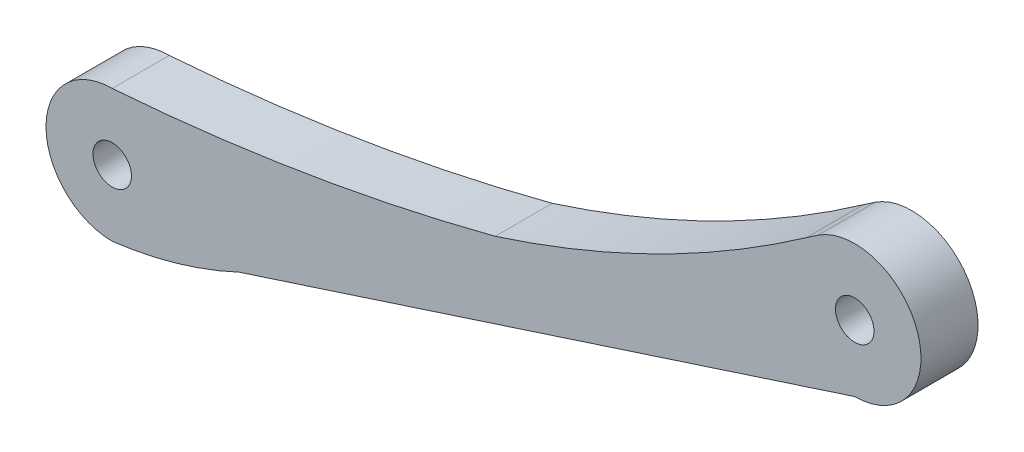
ISO-10303-21;
HEADER;
FILE_DESCRIPTION(('STEP AP214'),'2;1');
FILE_NAME('part.step','',(''),(''),'','','');
FILE_SCHEMA(('AUTOMOTIVE_DESIGN { 1 0 10303 214 1 1 1 1 }'));
ENDSEC;
DATA;
#1=APPLICATION_CONTEXT('core data for automotive mechanical design processes');
#2=APPLICATION_PROTOCOL_DEFINITION('international standard','automotive_design',2000,#1);
#3=PRODUCT_CONTEXT('',#1,'mechanical');
#4=PRODUCT('Part','Part','',(#3));
#5=PRODUCT_RELATED_PRODUCT_CATEGORY('part','',(#4));
#6=PRODUCT_DEFINITION_FORMATION('','',#4);
#7=PRODUCT_DEFINITION_CONTEXT('part definition',#1,'design');
#8=PRODUCT_DEFINITION('design','',#6,#7);
#9=PRODUCT_DEFINITION_SHAPE('','',#8);
#10=(LENGTH_UNIT() NAMED_UNIT(*) SI_UNIT(.MILLI.,.METRE.));
#11=(NAMED_UNIT(*) PLANE_ANGLE_UNIT() SI_UNIT($,.RADIAN.));
#12=(NAMED_UNIT(*) SI_UNIT($,.STERADIAN.) SOLID_ANGLE_UNIT());
#13=UNCERTAINTY_MEASURE_WITH_UNIT(LENGTH_MEASURE(1.E-05),#10,'distance_accuracy_value','');
#14=(GEOMETRIC_REPRESENTATION_CONTEXT(3) GLOBAL_UNCERTAINTY_ASSIGNED_CONTEXT((#13)) GLOBAL_UNIT_ASSIGNED_CONTEXT((#10,
#11,#12)) REPRESENTATION_CONTEXT('',''));
#15=CARTESIAN_POINT('',(0.,0.,0.));
#16=DIRECTION('',(0.,0.,1.));
#17=DIRECTION('',(1.,0.,0.));
#18=AXIS2_PLACEMENT_3D('',#15,#16,#17);
#19=CARTESIAN_POINT('',(3.52092702977232,128.68718187856,6.));
#20=DIRECTION('',(0.,0.,-1.));
#21=DIRECTION('',(-1.,0.,0.));
#22=AXIS2_PLACEMENT_3D('',#19,#20,#21);
#23=CYLINDRICAL_SURFACE('',#22,120.781117317153);
#24=CARTESIAN_POINT('',(3.52092702977232,128.68718187856,0.));
#25=DIRECTION('',(0.,0.,1.));
#26=DIRECTION('',(1.,0.,0.));
#27=AXIS2_PLACEMENT_3D('',#24,#25,#26);
#28=CIRCLE('',#27,120.781117317153);
#29=CARTESIAN_POINT('',(40.235925581119,13.6216041337166,0.));
#30=VERTEX_POINT('',#29);
#31=CARTESIAN_POINT('',(72.9383830734779,29.8474373584522,0.));
#32=VERTEX_POINT('',#31);
#33=EDGE_CURVE('E125',#30,#32,#28,.T.);
#34=ORIENTED_EDGE('',*,*,#33,.F.);
#35=DIRECTION('',(0.,0.,-1.));
#36=VECTOR('',#35,1.);
#37=CARTESIAN_POINT('',(40.235925581119,13.6216041337166,6.));
#38=LINE('',#37,#36);
#39=CARTESIAN_POINT('',(40.235925581119,13.6216041337166,6.));
#40=VERTEX_POINT('',#39);
#41=EDGE_CURVE('E11',#40,#30,#38,.T.);
#42=ORIENTED_EDGE('',*,*,#41,.F.);
#43=CARTESIAN_POINT('',(3.52092702977232,128.68718187856,6.));
#44=DIRECTION('',(0.,0.,1.));
#45=DIRECTION('',(1.,0.,0.));
#46=AXIS2_PLACEMENT_3D('',#43,#44,#45);
#47=CIRCLE('',#46,120.781117317153);
#48=CARTESIAN_POINT('',(72.9383830734779,29.8474373584522,6.));
#49=VERTEX_POINT('',#48);
#50=EDGE_CURVE('E145',#40,#49,#47,.T.);
#51=ORIENTED_EDGE('',*,*,#50,.T.);
#52=DIRECTION('',(0.,0.,-1.));
#53=VECTOR('',#52,1.);
#54=CARTESIAN_POINT('',(72.9383830734779,29.8474373584522,6.));
#55=LINE('',#54,#53);
#56=EDGE_CURVE('E80',#49,#32,#55,.T.);
#57=ORIENTED_EDGE('',*,*,#56,.T.);
#58=EDGE_LOOP('',(#34,#42,#51,#57));
#59=FACE_BOUND('',#58,.T.);
#60=ADVANCED_FACE('F32',(#59),#23,.F.);
#61=CARTESIAN_POINT('',(-16.5000266118403,231.345266574188,6.));
#62=DIRECTION('',(0.,0.,-1.));
#63=DIRECTION('',(-1.,0.,0.));
#64=AXIS2_PLACEMENT_3D('',#61,#62,#63);
#65=CYLINDRICAL_SURFACE('',#64,224.994580951929);
#66=CARTESIAN_POINT('',(-16.5000266118403,231.345266574188,0.));
#67=DIRECTION('',(0.,0.,1.));
#68=DIRECTION('',(1.,0.,0.));
#69=AXIS2_PLACEMENT_3D('',#66,#67,#68);
#70=CIRCLE('',#69,224.994580951929);
#71=CARTESIAN_POINT('',(0.,6.95651779309902,0.));
#72=VERTEX_POINT('',#71);
#73=EDGE_CURVE('E128',#72,#30,#70,.T.);
#74=ORIENTED_EDGE('',*,*,#73,.F.);
#75=DIRECTION('',(0.,0.,-1.));
#76=VECTOR('',#75,1.);
#77=CARTESIAN_POINT('',(0.,6.95651779309902,6.));
#78=LINE('',#77,#76);
#79=CARTESIAN_POINT('',(0.,6.95651779309902,6.));
#80=VERTEX_POINT('',#79);
#81=EDGE_CURVE('E40',#80,#72,#78,.T.);
#82=ORIENTED_EDGE('',*,*,#81,.F.);
#83=CARTESIAN_POINT('',(-16.5000266118403,231.345266574188,6.));
#84=DIRECTION('',(0.,0.,1.));
#85=DIRECTION('',(1.,0.,0.));
#86=AXIS2_PLACEMENT_3D('',#83,#84,#85);
#87=CIRCLE('',#86,224.994580951929);
#88=EDGE_CURVE('E166',#80,#40,#87,.T.);
#89=ORIENTED_EDGE('',*,*,#88,.T.);
#90=ORIENTED_EDGE('',*,*,#41,.T.);
#91=EDGE_LOOP('',(#74,#82,#89,#90));
#92=FACE_BOUND('',#91,.T.);
#93=ADVANCED_FACE('F165',(#92),#65,.F.);
#94=CARTESIAN_POINT('',(0.,0.,6.));
#95=DIRECTION('',(0.,0.,-1.));
#96=DIRECTION('',(-1.,0.,0.));
#97=AXIS2_PLACEMENT_3D('',#94,#95,#96);
#98=CYLINDRICAL_SURFACE('',#97,6.95651779309902);
#99=CARTESIAN_POINT('',(0.,0.,0.));
#100=DIRECTION('',(0.,0.,1.));
#101=DIRECTION('',(1.,0.,0.));
#102=AXIS2_PLACEMENT_3D('',#99,#100,#101);
#103=CIRCLE('',#102,6.95651779309902);
#104=CARTESIAN_POINT('',(0.,-6.95651779309902,0.));
#105=VERTEX_POINT('',#104);
#106=EDGE_CURVE('E131',#72,#105,#103,.T.);
#107=ORIENTED_EDGE('',*,*,#106,.T.);
#108=DIRECTION('',(0.,0.,-1.));
#109=VECTOR('',#108,1.);
#110=CARTESIAN_POINT('',(0.,-6.95651779309902,6.));
#111=LINE('',#110,#109);
#112=CARTESIAN_POINT('',(0.,-6.95651779309902,6.));
#113=VERTEX_POINT('',#112);
#114=EDGE_CURVE('E149',#113,#105,#111,.T.);
#115=ORIENTED_EDGE('',*,*,#114,.F.);
#116=CARTESIAN_POINT('',(0.,0.,6.));
#117=DIRECTION('',(0.,0.,1.));
#118=DIRECTION('',(1.,0.,0.));
#119=AXIS2_PLACEMENT_3D('',#116,#117,#118);
#120=CIRCLE('',#119,6.95651779309902);
#121=EDGE_CURVE('E156',#80,#113,#120,.T.);
#122=ORIENTED_EDGE('',*,*,#121,.F.);
#123=ORIENTED_EDGE('',*,*,#81,.T.);
#124=EDGE_LOOP('',(#107,#115,#122,#123));
#125=FACE_BOUND('',#124,.T.);
#126=ADVANCED_FACE('F154',(#125),#98,.T.);
#127=CARTESIAN_POINT('',(-5.43504198912419,36.7736432938048,6.));
#128=DIRECTION('',(0.,0.,-1.));
#129=DIRECTION('',(-1.,0.,0.));
#130=AXIS2_PLACEMENT_3D('',#127,#128,#129);
#131=CYLINDRICAL_SURFACE('',#130,44.0666162770651);
#132=CARTESIAN_POINT('',(-5.43504198912419,36.7736432938048,0.));
#133=DIRECTION('',(0.,0.,1.));
#134=DIRECTION('',(1.,0.,0.));
#135=AXIS2_PLACEMENT_3D('',#132,#133,#134);
#136=CIRCLE('',#135,44.0666162770651);
#137=CARTESIAN_POINT('',(13.3235006682701,-3.10095698608287,0.));
#138=VERTEX_POINT('',#137);
#139=EDGE_CURVE('E133',#105,#138,#136,.T.);
#140=ORIENTED_EDGE('',*,*,#139,.T.);
#141=DIRECTION('',(0.,0.,-1.));
#142=VECTOR('',#141,1.);
#143=CARTESIAN_POINT('',(13.3235006682701,-3.10095698608287,6.));
#144=LINE('',#143,#142);
#145=CARTESIAN_POINT('',(13.3235006682701,-3.10095698608287,6.));
#146=VERTEX_POINT('',#145);
#147=EDGE_CURVE('E111',#146,#138,#144,.T.);
#148=ORIENTED_EDGE('',*,*,#147,.F.);
#149=CARTESIAN_POINT('',(-5.43504198912419,36.7736432938048,6.));
#150=DIRECTION('',(0.,0.,1.));
#151=DIRECTION('',(1.,0.,0.));
#152=AXIS2_PLACEMENT_3D('',#149,#150,#151);
#153=CIRCLE('',#152,44.0666162770651);
#154=EDGE_CURVE('E102',#113,#146,#153,.T.);
#155=ORIENTED_EDGE('',*,*,#154,.F.);
#156=ORIENTED_EDGE('',*,*,#114,.T.);
#157=EDGE_LOOP('',(#140,#148,#155,#156));
#158=FACE_BOUND('',#157,.T.);
#159=ADVANCED_FACE('F174',(#158),#131,.T.);
#160=CARTESIAN_POINT('',(2.18464276354417,-6.72139803148819,6.));
#161=DIRECTION('',(-0.309110183145973,0.951026232380297,0.));
#162=DIRECTION('',(-0.951026232380297,-0.309110183145973,0.));
#163=AXIS2_PLACEMENT_3D('',#160,#161,#162);
#164=PLANE('',#163);
#165=DIRECTION('',(0.951026232380297,0.309110183145973,0.));
#166=VECTOR('',#165,1.);
#167=CARTESIAN_POINT('',(2.18464276354417,-6.72139803148819,0.));
#168=LINE('',#167,#166);
#169=CARTESIAN_POINT('',(78.0200191531507,17.9272249892081,0.));
#170=VERTEX_POINT('',#169);
#171=EDGE_CURVE('E110',#138,#170,#168,.T.);
#172=ORIENTED_EDGE('',*,*,#171,.T.);
#173=DIRECTION('',(0.,0.,-1.));
#174=VECTOR('',#173,1.);
#175=CARTESIAN_POINT('',(78.0200191531507,17.9272249892081,6.));
#176=LINE('',#175,#174);
#177=CARTESIAN_POINT('',(78.0200191531507,17.9272249892081,6.));
#178=VERTEX_POINT('',#177);
#179=EDGE_CURVE('E107',#178,#170,#176,.T.);
#180=ORIENTED_EDGE('',*,*,#179,.F.);
#181=DIRECTION('',(0.951026232380297,0.309110183145973,0.));
#182=VECTOR('',#181,1.);
#183=CARTESIAN_POINT('',(2.18464276354417,-6.72139803148819,6.));
#184=LINE('',#183,#182);
#185=EDGE_CURVE('E95',#146,#178,#184,.T.);
#186=ORIENTED_EDGE('',*,*,#185,.F.);
#187=ORIENTED_EDGE('',*,*,#147,.T.);
#188=EDGE_LOOP('',(#172,#180,#186,#187));
#189=FACE_BOUND('',#188,.T.);
#190=ADVANCED_FACE('F108',(#189),#164,.F.);
#191=CARTESIAN_POINT('',(78.0200191531507,24.8875466609063,6.));
#192=DIRECTION('',(0.,0.,-1.));
#193=DIRECTION('',(-1.,0.,0.));
#194=AXIS2_PLACEMENT_3D('',#191,#192,#193);
#195=CYLINDRICAL_SURFACE('',#194,6.96032167169823);
#196=CARTESIAN_POINT('',(78.0200191531507,24.8875466609063,0.));
#197=DIRECTION('',(0.,0.,1.));
#198=DIRECTION('',(1.,0.,0.));
#199=AXIS2_PLACEMENT_3D('',#196,#197,#198);
#200=CIRCLE('',#199,6.96032167169823);
#201=CARTESIAN_POINT('',(74.1564479492747,30.677097189755,0.));
#202=VERTEX_POINT('',#201);
#203=EDGE_CURVE('E73',#170,#202,#200,.T.);
#204=ORIENTED_EDGE('',*,*,#203,.T.);
#205=DIRECTION('',(0.,0.,-1.));
#206=VECTOR('',#205,1.);
#207=CARTESIAN_POINT('',(74.1564479492747,30.677097189755,6.));
#208=LINE('',#207,#206);
#209=CARTESIAN_POINT('',(74.1564479492747,30.677097189755,6.));
#210=VERTEX_POINT('',#209);
#211=EDGE_CURVE('E112',#210,#202,#208,.T.);
#212=ORIENTED_EDGE('',*,*,#211,.F.);
#213=CARTESIAN_POINT('',(78.0200191531507,24.8875466609063,6.));
#214=DIRECTION('',(0.,0.,1.));
#215=DIRECTION('',(1.,0.,0.));
#216=AXIS2_PLACEMENT_3D('',#213,#214,#215);
#217=CIRCLE('',#216,6.96032167169823);
#218=EDGE_CURVE('E100',#178,#210,#217,.T.);
#219=ORIENTED_EDGE('',*,*,#218,.F.);
#220=ORIENTED_EDGE('',*,*,#179,.T.);
#221=EDGE_LOOP('',(#204,#212,#219,#220));
#222=FACE_BOUND('',#221,.T.);
#223=ADVANCED_FACE('F114',(#222),#195,.T.);
#224=CARTESIAN_POINT('',(78.0200191531507,24.8875466609063,6.));
#225=DIRECTION('',(0.,0.,-1.));
#226=DIRECTION('',(-1.,0.,0.));
#227=AXIS2_PLACEMENT_3D('',#224,#225,#226);
#228=CYLINDRICAL_SURFACE('',#227,2.02398786423874);
#229=CARTESIAN_POINT('',(78.0200191531507,24.8875466609063,6.));
#230=DIRECTION('',(0.,0.,1.));
#231=DIRECTION('',(1.,0.,0.));
#232=AXIS2_PLACEMENT_3D('',#229,#230,#231);
#233=CIRCLE('',#232,2.02398786423874);
#234=CARTESIAN_POINT('',(80.0440070173894,24.8875466609063,6.));
#235=VERTEX_POINT('',#234);
#236=EDGE_CURVE('E116',#235,#235,#233,.T.);
#237=ORIENTED_EDGE('',*,*,#236,.T.);
#238=EDGE_LOOP('',(#237));
#239=FACE_BOUND('',#238,.T.);
#240=CARTESIAN_POINT('',(78.0200191531507,24.8875466609063,0.));
#241=DIRECTION('',(0.,0.,1.));
#242=DIRECTION('',(1.,0.,0.));
#243=AXIS2_PLACEMENT_3D('',#240,#241,#242);
#244=CIRCLE('',#243,2.02398786423874);
#245=CARTESIAN_POINT('',(80.0440070173894,24.8875466609063,0.));
#246=VERTEX_POINT('',#245);
#247=EDGE_CURVE('E139',#246,#246,#244,.T.);
#248=ORIENTED_EDGE('',*,*,#247,.F.);
#249=EDGE_LOOP('',(#248));
#250=FACE_BOUND('',#249,.T.);
#251=ADVANCED_FACE('F204',(#239,#250),#228,.F.);
#252=CARTESIAN_POINT('',(9.22776432351113,-13.547739905582,6.));
#253=DIRECTION('',(0.562948162750431,-0.826492205683704,0.));
#254=DIRECTION('',(0.826492205683704,0.562948162750431,0.));
#255=AXIS2_PLACEMENT_3D('',#252,#253,#254);
#256=PLANE('',#255);
#257=DIRECTION('',(-0.826492205683704,-0.562948162750431,0.));
#258=VECTOR('',#257,1.);
#259=CARTESIAN_POINT('',(9.22776432351113,-13.547739905582,0.));
#260=LINE('',#259,#258);
#261=EDGE_CURVE('E137',#202,#32,#260,.T.);
#262=ORIENTED_EDGE('',*,*,#261,.T.);
#263=ORIENTED_EDGE('',*,*,#56,.F.);
#264=DIRECTION('',(-0.826492205683704,-0.562948162750431,0.));
#265=VECTOR('',#264,1.);
#266=CARTESIAN_POINT('',(9.22776432351113,-13.547739905582,6.));
#267=LINE('',#266,#265);
#268=EDGE_CURVE('E48',#210,#49,#267,.T.);
#269=ORIENTED_EDGE('',*,*,#268,.F.);
#270=ORIENTED_EDGE('',*,*,#211,.T.);
#271=EDGE_LOOP('',(#262,#263,#269,#270));
#272=FACE_BOUND('',#271,.T.);
#273=ADVANCED_FACE('F169',(#272),#256,.F.);
#274=CARTESIAN_POINT('',(0.,0.,6.));
#275=DIRECTION('',(0.,0.,-1.));
#276=DIRECTION('',(-1.,0.,0.));
#277=AXIS2_PLACEMENT_3D('',#274,#275,#276);
#278=CYLINDRICAL_SURFACE('',#277,2.02304351129445);
#279=CARTESIAN_POINT('',(0.,0.,6.));
#280=DIRECTION('',(0.,0.,1.));
#281=DIRECTION('',(1.,0.,0.));
#282=AXIS2_PLACEMENT_3D('',#279,#280,#281);
#283=CIRCLE('',#282,2.02304351129445);
#284=CARTESIAN_POINT('',(2.02304351129445,0.,6.));
#285=VERTEX_POINT('',#284);
#286=EDGE_CURVE('E122',#285,#285,#283,.T.);
#287=ORIENTED_EDGE('',*,*,#286,.T.);
#288=EDGE_LOOP('',(#287));
#289=FACE_BOUND('',#288,.T.);
#290=CARTESIAN_POINT('',(0.,0.,0.));
#291=DIRECTION('',(0.,0.,1.));
#292=DIRECTION('',(1.,0.,0.));
#293=AXIS2_PLACEMENT_3D('',#290,#291,#292);
#294=CIRCLE('',#293,2.02304351129445);
#295=CARTESIAN_POINT('',(2.02304351129445,0.,0.));
#296=VERTEX_POINT('',#295);
#297=EDGE_CURVE('E142',#296,#296,#294,.T.);
#298=ORIENTED_EDGE('',*,*,#297,.F.);
#299=EDGE_LOOP('',(#298));
#300=FACE_BOUND('',#299,.T.);
#301=ADVANCED_FACE('F203',(#289,#300),#278,.F.);
#302=CARTESIAN_POINT('',(0.,0.,6.));
#303=DIRECTION('',(0.,0.,1.));
#304=DIRECTION('',(1.,0.,0.));
#305=AXIS2_PLACEMENT_3D('',#302,#303,#304);
#306=PLANE('',#305);
#307=ORIENTED_EDGE('',*,*,#50,.F.);
#308=ORIENTED_EDGE('',*,*,#88,.F.);
#309=ORIENTED_EDGE('',*,*,#121,.T.);
#310=ORIENTED_EDGE('',*,*,#154,.T.);
#311=ORIENTED_EDGE('',*,*,#185,.T.);
#312=ORIENTED_EDGE('',*,*,#218,.T.);
#313=ORIENTED_EDGE('',*,*,#268,.T.);
#314=EDGE_LOOP('',(#307,#308,#309,#310,#311,#312,#313));
#315=FACE_BOUND('',#314,.T.);
#316=ORIENTED_EDGE('',*,*,#236,.F.);
#317=EDGE_LOOP('',(#316));
#318=FACE_BOUND('',#317,.T.);
#319=ORIENTED_EDGE('',*,*,#286,.F.);
#320=EDGE_LOOP('',(#319));
#321=FACE_BOUND('',#320,.T.);
#322=ADVANCED_FACE('F97',(#315,#318,#321),#306,.T.);
#323=CARTESIAN_POINT('',(0.,0.,0.));
#324=DIRECTION('',(0.,0.,1.));
#325=DIRECTION('',(1.,0.,0.));
#326=AXIS2_PLACEMENT_3D('',#323,#324,#325);
#327=PLANE('',#326);
#328=ORIENTED_EDGE('',*,*,#33,.T.);
#329=ORIENTED_EDGE('',*,*,#261,.F.);
#330=ORIENTED_EDGE('',*,*,#203,.F.);
#331=ORIENTED_EDGE('',*,*,#171,.F.);
#332=ORIENTED_EDGE('',*,*,#139,.F.);
#333=ORIENTED_EDGE('',*,*,#106,.F.);
#334=ORIENTED_EDGE('',*,*,#73,.T.);
#335=EDGE_LOOP('',(#328,#329,#330,#331,#332,#333,#334));
#336=FACE_BOUND('',#335,.T.);
#337=ORIENTED_EDGE('',*,*,#247,.T.);
#338=EDGE_LOOP('',(#337));
#339=FACE_BOUND('',#338,.T.);
#340=ORIENTED_EDGE('',*,*,#297,.T.);
#341=EDGE_LOOP('',(#340));
#342=FACE_BOUND('',#341,.T.);
#343=ADVANCED_FACE('F163',(#336,#339,#342),#327,.F.);
#344=CLOSED_SHELL('',(#60,#93,#126,#159,#190,#223,#251,#273,#301,#322,#343));
#345=MANIFOLD_SOLID_BREP('B2',#344);
#346=ADVANCED_BREP_SHAPE_REPRESENTATION('',(#18,#345),#14);
#347=SHAPE_DEFINITION_REPRESENTATION(#9,#346);
ENDSEC;
END-ISO-10303-21;
